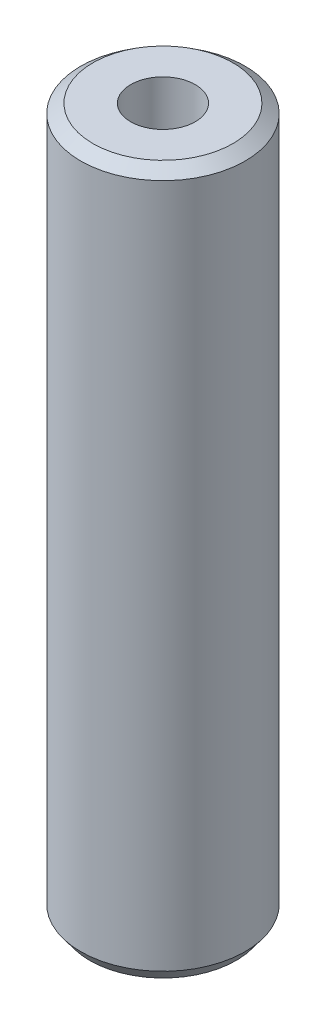
ISO-10303-21;
HEADER;
FILE_DESCRIPTION(('STEP AP214'),'2;1');
FILE_NAME('part.step','',(''),(''),'','','');
FILE_SCHEMA(('AUTOMOTIVE_DESIGN { 1 0 10303 214 1 1 1 1 }'));
ENDSEC;
DATA;
#1=APPLICATION_CONTEXT('core data for automotive mechanical design processes');
#2=APPLICATION_PROTOCOL_DEFINITION('international standard','automotive_design',2000,#1);
#3=PRODUCT_CONTEXT('',#1,'mechanical');
#4=PRODUCT('Part','Part','',(#3));
#5=PRODUCT_RELATED_PRODUCT_CATEGORY('part','',(#4));
#6=PRODUCT_DEFINITION_FORMATION('','',#4);
#7=PRODUCT_DEFINITION_CONTEXT('part definition',#1,'design');
#8=PRODUCT_DEFINITION('design','',#6,#7);
#9=PRODUCT_DEFINITION_SHAPE('','',#8);
#10=(LENGTH_UNIT() NAMED_UNIT(*) SI_UNIT(.MILLI.,.METRE.));
#11=(NAMED_UNIT(*) PLANE_ANGLE_UNIT() SI_UNIT($,.RADIAN.));
#12=(NAMED_UNIT(*) SI_UNIT($,.STERADIAN.) SOLID_ANGLE_UNIT());
#13=UNCERTAINTY_MEASURE_WITH_UNIT(LENGTH_MEASURE(1.E-05),#10,'distance_accuracy_value','');
#14=(GEOMETRIC_REPRESENTATION_CONTEXT(3) GLOBAL_UNCERTAINTY_ASSIGNED_CONTEXT((#13)) GLOBAL_UNIT_ASSIGNED_CONTEXT((#10,
#11,#12)) REPRESENTATION_CONTEXT('',''));
#15=CARTESIAN_POINT('',(0.,0.,0.));
#16=DIRECTION('',(0.,0.,1.));
#17=DIRECTION('',(1.,0.,0.));
#18=AXIS2_PLACEMENT_3D('',#15,#16,#17);
#19=CARTESIAN_POINT('',(0.,257.552341020046,0.));
#20=DIRECTION('',(0.,-1.,0.));
#21=DIRECTION('',(0.,0.,-1.));
#22=AXIS2_PLACEMENT_3D('',#19,#20,#21);
#23=CYLINDRICAL_SURFACE('',#22,30.);
#24=CARTESIAN_POINT('',(0.,254.265141346609,0.));
#25=DIRECTION('',(0.,1.,0.));
#26=DIRECTION('',(0.,0.,1.));
#27=AXIS2_PLACEMENT_3D('',#24,#25,#26);
#28=CIRCLE('',#27,30.);
#29=CARTESIAN_POINT('',(0.,254.265141346609,30.));
#30=VERTEX_POINT('',#29);
#31=EDGE_CURVE('E50',#30,#30,#28,.F.);
#32=ORIENTED_EDGE('',*,*,#31,.T.);
#33=EDGE_LOOP('',(#32));
#34=FACE_BOUND('',#33,.T.);
#35=CARTESIAN_POINT('',(0.,4.45152090402079,0.));
#36=DIRECTION('',(0.,1.,0.));
#37=DIRECTION('',(0.,0.,1.));
#38=AXIS2_PLACEMENT_3D('',#35,#36,#37);
#39=CIRCLE('',#38,30.);
#40=CARTESIAN_POINT('',(0.,4.45152090402079,30.));
#41=VERTEX_POINT('',#40);
#42=EDGE_CURVE('E51',#41,#41,#39,.T.);
#43=ORIENTED_EDGE('',*,*,#42,.T.);
#44=EDGE_LOOP('',(#43));
#45=FACE_BOUND('',#44,.T.);
#46=ADVANCED_FACE('F39',(#34,#45),#23,.T.);
#47=CARTESIAN_POINT('',(0.,257.552341020046,0.));
#48=DIRECTION('',(0.,1.,0.));
#49=DIRECTION('',(0.,0.,1.));
#50=AXIS2_PLACEMENT_3D('',#47,#48,#49);
#51=PLANE('',#50);
#52=CARTESIAN_POINT('',(0.,257.552341020046,0.));
#53=DIRECTION('',(0.,1.,0.));
#54=DIRECTION('',(0.,0.,1.));
#55=AXIS2_PLACEMENT_3D('',#52,#53,#54);
#56=CIRCLE('',#55,25.5484790959792);
#57=CARTESIAN_POINT('',(0.,257.552341020046,25.5484790959792));
#58=VERTEX_POINT('',#57);
#59=EDGE_CURVE('E54',#58,#58,#56,.T.);
#60=ORIENTED_EDGE('',*,*,#59,.T.);
#61=EDGE_LOOP('',(#60));
#62=FACE_BOUND('',#61,.T.);
#63=CARTESIAN_POINT('',(0.,257.552341020046,0.));
#64=DIRECTION('',(0.,1.,0.));
#65=DIRECTION('',(0.,0.,1.));
#66=AXIS2_PLACEMENT_3D('',#63,#64,#65);
#67=CIRCLE('',#66,11.7693326058594);
#68=CARTESIAN_POINT('',(0.,257.552341020046,11.7693326058594));
#69=VERTEX_POINT('',#68);
#70=EDGE_CURVE('E58',#69,#69,#67,.T.);
#71=ORIENTED_EDGE('',*,*,#70,.F.);
#72=EDGE_LOOP('',(#71));
#73=FACE_BOUND('',#72,.T.);
#74=ADVANCED_FACE('F69',(#62,#73),#51,.T.);
#75=CARTESIAN_POINT('',(0.,0.,0.));
#76=DIRECTION('',(0.,1.,0.));
#77=DIRECTION('',(0.,0.,1.));
#78=AXIS2_PLACEMENT_3D('',#75,#76,#77);
#79=PLANE('',#78);
#80=CARTESIAN_POINT('',(0.,0.,0.));
#81=DIRECTION('',(0.,1.,0.));
#82=DIRECTION('',(0.,0.,1.));
#83=AXIS2_PLACEMENT_3D('',#80,#81,#82);
#84=CIRCLE('',#83,26.7128003265629);
#85=CARTESIAN_POINT('',(0.,0.,26.7128003265629));
#86=VERTEX_POINT('',#85);
#87=EDGE_CURVE('E10',#86,#86,#84,.F.);
#88=ORIENTED_EDGE('',*,*,#87,.T.);
#89=EDGE_LOOP('',(#88));
#90=FACE_BOUND('',#89,.T.);
#91=CARTESIAN_POINT('',(0.,0.,0.));
#92=DIRECTION('',(0.,1.,0.));
#93=DIRECTION('',(0.,0.,1.));
#94=AXIS2_PLACEMENT_3D('',#91,#92,#93);
#95=CIRCLE('',#94,11.7693326058594);
#96=CARTESIAN_POINT('',(0.,0.,11.7693326058594));
#97=VERTEX_POINT('',#96);
#98=EDGE_CURVE('E63',#97,#97,#95,.T.);
#99=ORIENTED_EDGE('',*,*,#98,.T.);
#100=EDGE_LOOP('',(#99));
#101=FACE_BOUND('',#100,.T.);
#102=ADVANCED_FACE('F75',(#90,#101),#79,.F.);
#103=CARTESIAN_POINT('',(0.,257.552341020046,0.));
#104=DIRECTION('',(0.,-1.,0.));
#105=DIRECTION('',(0.,0.,-1.));
#106=AXIS2_PLACEMENT_3D('',#103,#104,#105);
#107=CYLINDRICAL_SURFACE('',#106,11.7693326058594);
#108=ORIENTED_EDGE('',*,*,#70,.T.);
#109=EDGE_LOOP('',(#108));
#110=FACE_BOUND('',#109,.T.);
#111=ORIENTED_EDGE('',*,*,#98,.F.);
#112=EDGE_LOOP('',(#111));
#113=FACE_BOUND('',#112,.T.);
#114=ADVANCED_FACE('F70',(#110,#113),#107,.F.);
#115=CARTESIAN_POINT('',(0.,257.552341020046,0.));
#116=DIRECTION('',(0.,-1.,0.));
#117=DIRECTION('',(0.,0.,-1.));
#118=AXIS2_PLACEMENT_3D('',#115,#116,#117);
#119=CONICAL_SURFACE('',#118,25.5484790959792,0.934732061471012);
#120=ORIENTED_EDGE('',*,*,#31,.F.);
#121=EDGE_LOOP('',(#120));
#122=FACE_BOUND('',#121,.T.);
#123=ORIENTED_EDGE('',*,*,#59,.F.);
#124=EDGE_LOOP('',(#123));
#125=FACE_BOUND('',#124,.T.);
#126=ADVANCED_FACE('F81',(#122,#125),#119,.T.);
#127=CARTESIAN_POINT('',(0.,4.45152090402079,0.));
#128=DIRECTION('',(0.,1.,0.));
#129=DIRECTION('',(0.,0.,1.));
#130=AXIS2_PLACEMENT_3D('',#127,#128,#129);
#131=CONICAL_SURFACE('',#130,30.,0.636064265323886);
#132=ORIENTED_EDGE('',*,*,#87,.F.);
#133=EDGE_LOOP('',(#132));
#134=FACE_BOUND('',#133,.T.);
#135=ORIENTED_EDGE('',*,*,#42,.F.);
#136=EDGE_LOOP('',(#135));
#137=FACE_BOUND('',#136,.T.);
#138=ADVANCED_FACE('F45',(#134,#137),#131,.T.);
#139=CLOSED_SHELL('',(#46,#74,#102,#114,#126,#138));
#140=MANIFOLD_SOLID_BREP('B2',#139);
#141=ADVANCED_BREP_SHAPE_REPRESENTATION('',(#18,#140),#14);
#142=SHAPE_DEFINITION_REPRESENTATION(#9,#141);
ENDSEC;
END-ISO-10303-21;
